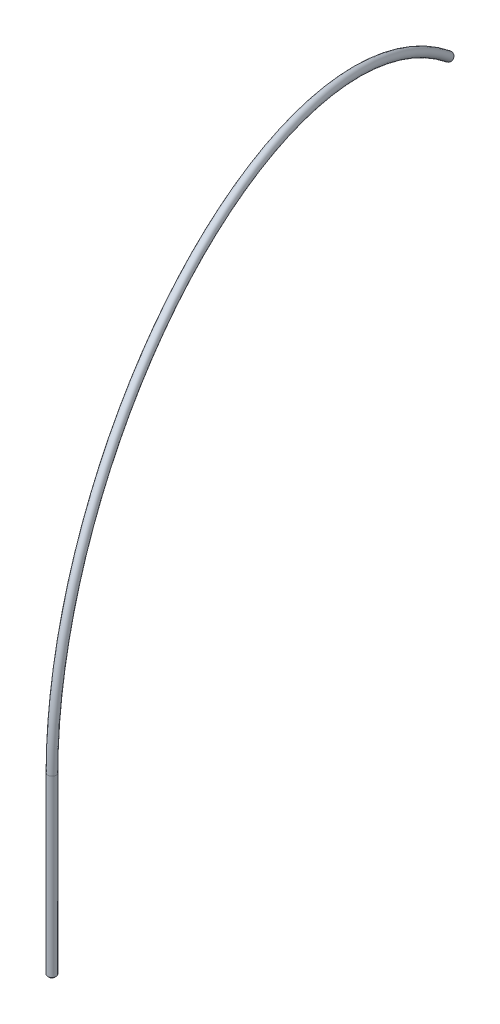
ISO-10303-21;
HEADER;
FILE_DESCRIPTION(('STEP AP214'),'2;1');
FILE_NAME('part.step','',(''),(''),'','','');
FILE_SCHEMA(('AUTOMOTIVE_DESIGN { 1 0 10303 214 1 1 1 1 }'));
ENDSEC;
DATA;
#1=APPLICATION_CONTEXT('core data for automotive mechanical design processes');
#2=APPLICATION_PROTOCOL_DEFINITION('international standard','automotive_design',2000,#1);
#3=PRODUCT_CONTEXT('',#1,'mechanical');
#4=PRODUCT('Part','Part','',(#3));
#5=PRODUCT_RELATED_PRODUCT_CATEGORY('part','',(#4));
#6=PRODUCT_DEFINITION_FORMATION('','',#4);
#7=PRODUCT_DEFINITION_CONTEXT('part definition',#1,'design');
#8=PRODUCT_DEFINITION('design','',#6,#7);
#9=PRODUCT_DEFINITION_SHAPE('','',#8);
#10=(LENGTH_UNIT() NAMED_UNIT(*) SI_UNIT(.MILLI.,.METRE.));
#11=(NAMED_UNIT(*) PLANE_ANGLE_UNIT() SI_UNIT($,.RADIAN.));
#12=(NAMED_UNIT(*) SI_UNIT($,.STERADIAN.) SOLID_ANGLE_UNIT());
#13=UNCERTAINTY_MEASURE_WITH_UNIT(LENGTH_MEASURE(1.E-05),#10,'distance_accuracy_value','');
#14=(GEOMETRIC_REPRESENTATION_CONTEXT(3) GLOBAL_UNCERTAINTY_ASSIGNED_CONTEXT((#13)) GLOBAL_UNIT_ASSIGNED_CONTEXT((#10,
#11,#12)) REPRESENTATION_CONTEXT('',''));
#15=CARTESIAN_POINT('',(0.,0.,0.));
#16=DIRECTION('',(0.,0.,1.));
#17=DIRECTION('',(1.,0.,0.));
#18=AXIS2_PLACEMENT_3D('',#15,#16,#17);
#19=CARTESIAN_POINT('',(0.,0.,0.));
#20=DIRECTION('',(0.,-1.,0.));
#21=DIRECTION('',(0.,0.,-1.));
#22=AXIS2_PLACEMENT_3D('',#19,#20,#21);
#23=CYLINDRICAL_SURFACE('',#22,1.5875);
#24=CARTESIAN_POINT('',(0.,0.,0.));
#25=DIRECTION('',(0.,-1.,0.));
#26=DIRECTION('',(0.,0.,-1.));
#27=AXIS2_PLACEMENT_3D('',#24,#25,#26);
#28=CIRCLE('',#27,1.58750000000001);
#29=CARTESIAN_POINT('',(0.,0.,-1.58750000000001));
#30=VERTEX_POINT('',#29);
#31=EDGE_CURVE('E10',#30,#30,#28,.T.);
#32=ORIENTED_EDGE('',*,*,#31,.T.);
#33=EDGE_LOOP('',(#32));
#34=FACE_BOUND('',#33,.T.);
#35=CARTESIAN_POINT('',(0.,100.79375,0.));
#36=DIRECTION('',(0.,-1.,0.));
#37=DIRECTION('',(0.,0.,-1.));
#38=AXIS2_PLACEMENT_3D('',#35,#36,#37);
#39=CIRCLE('',#38,1.58749999999999);
#40=CARTESIAN_POINT('',(0.427311452455385,100.79375,1.52890849059073));
#41=VERTEX_POINT('',#40);
#42=EDGE_CURVE('E32',#41,#41,#39,.T.);
#43=ORIENTED_EDGE('',*,*,#42,.F.);
#44=EDGE_LOOP('',(#43));
#45=FACE_BOUND('',#44,.T.);
#46=ADVANCED_FACE('F29',(#34,#45),#23,.F.);
#47=CARTESIAN_POINT('',(0.,0.,0.));
#48=DIRECTION('',(0.,1.,0.));
#49=DIRECTION('',(0.,0.,1.));
#50=AXIS2_PLACEMENT_3D('',#47,#48,#49);
#51=CONICAL_SURFACE('',#50,1.58750000000001,0.78539816339745);
#52=CARTESIAN_POINT('',(0.,0.793749999999998,0.));
#53=DIRECTION('',(0.,-1.,0.));
#54=DIRECTION('',(0.,0.,-1.));
#55=AXIS2_PLACEMENT_3D('',#52,#53,#54);
#56=CIRCLE('',#55,2.38125000000001);
#57=CARTESIAN_POINT('',(0.,0.793749999999998,-2.38125000000001));
#58=VERTEX_POINT('',#57);
#59=EDGE_CURVE('E36',#58,#58,#56,.T.);
#60=ORIENTED_EDGE('',*,*,#59,.T.);
#61=EDGE_LOOP('',(#60));
#62=FACE_BOUND('',#61,.T.);
#63=ORIENTED_EDGE('',*,*,#31,.F.);
#64=EDGE_LOOP('',(#63));
#65=FACE_BOUND('',#64,.T.);
#66=ADVANCED_FACE('F74',(#62,#65),#51,.T.);
#67=CARTESIAN_POINT('',(0.,0.,0.));
#68=DIRECTION('',(0.,-1.,0.));
#69=DIRECTION('',(0.,0.,-1.));
#70=AXIS2_PLACEMENT_3D('',#67,#68,#69);
#71=CYLINDRICAL_SURFACE('',#70,2.38125);
#72=CARTESIAN_POINT('',(0.,100.79375,0.));
#73=DIRECTION('',(0.,-1.,0.));
#74=DIRECTION('',(0.,0.,-1.));
#75=AXIS2_PLACEMENT_3D('',#72,#73,#74);
#76=CIRCLE('',#75,2.38124999999999);
#77=CARTESIAN_POINT('',(0.640967178683082,100.79375,2.29336273588612));
#78=VERTEX_POINT('',#77);
#79=EDGE_CURVE('E41',#78,#78,#76,.T.);
#80=ORIENTED_EDGE('',*,*,#79,.T.);
#81=EDGE_LOOP('',(#80));
#82=FACE_BOUND('',#81,.T.);
#83=ORIENTED_EDGE('',*,*,#59,.F.);
#84=EDGE_LOOP('',(#83));
#85=FACE_BOUND('',#84,.T.);
#86=ADVANCED_FACE('F72',(#82,#85),#71,.T.);
#87=CARTESIAN_POINT('',(-53.8345136951666,100.79375,-192.618392515369));
#88=DIRECTION('',(0.963091962576847,0.,-0.269172568475833));
#89=DIRECTION('',(-0.269172568475833,0.,-0.963091962576847));
#90=AXIS2_PLACEMENT_3D('',#87,#88,#89);
#91=TOROIDAL_SURFACE('',#90,200.,1.58749999999999);
#92=CARTESIAN_POINT('',(-88.2162172536232,254.692322300197,-315.635171470028));
#93=DIRECTION('',(-0.207126369954039,-0.638655412643645,-0.741092390171858));
#94=DIRECTION('',(-0.424801649029487,0.741092390171858,-0.519928483746746));
#95=AXIS2_PLACEMENT_3D('',#92,#93,#94);
#96=CIRCLE('',#95,1.58749999999999);
#97=CARTESIAN_POINT('',(-88.4891220256184,255.91389221783,-316.611617152981));
#98=VERTEX_POINT('',#97);
#99=EDGE_CURVE('E52',#98,#98,#96,.T.);
#100=CARTESIAN_POINT('',(-53.8345136951666,100.79375,-192.618392515369));
#101=DIRECTION('',(0.963091962576847,0.,-0.269172568475833));
#102=DIRECTION('',(-0.269172568475833,0.,-0.963091962576847));
#103=AXIS2_PLACEMENT_3D('',#100,#101,#102);
#104=CIRCLE('',#103,201.5875);
#105=EDGE_CURVE('',#98,#41,#104,.T.);
#106=ORIENTED_EDGE('',*,*,#99,.T.);
#107=ORIENTED_EDGE('',*,*,#42,.T.);
#108=ORIENTED_EDGE('',*,*,#105,.T.);
#109=ORIENTED_EDGE('',*,*,#105,.F.);
#110=EDGE_LOOP('',(#106,#108,#107,#109));
#111=FACE_BOUND('',#110,.T.);
#112=ADVANCED_FACE('F59',(#111),#91,.F.);
#113=CARTESIAN_POINT('',(-53.8345136951666,100.79375,-192.618392515369));
#114=DIRECTION('',(0.963091962576847,0.,-0.269172568475833));
#115=DIRECTION('',(-0.269172568475833,0.,-0.963091962576847));
#116=AXIS2_PLACEMENT_3D('',#113,#114,#115);
#117=TOROIDAL_SURFACE('',#116,200.,2.38124999999999);
#118=CARTESIAN_POINT('',(-88.2162172536232,254.692322300197,-315.635171470028));
#119=DIRECTION('',(-0.207126369954039,-0.638655412643645,-0.741092390171858));
#120=DIRECTION('',(-0.424801649029487,0.741092390171858,-0.519928483746746));
#121=AXIS2_PLACEMENT_3D('',#118,#119,#120);
#122=CIRCLE('',#121,2.38124999999999);
#123=CARTESIAN_POINT('',(-88.6255744116161,256.524677176646,-317.099839994457));
#124=VERTEX_POINT('',#123);
#125=EDGE_CURVE('E48',#124,#124,#122,.T.);
#126=CARTESIAN_POINT('',(-53.8345136951666,100.79375,-192.618392515369));
#127=DIRECTION('',(0.963091962576847,0.,-0.269172568475833));
#128=DIRECTION('',(-0.269172568475833,0.,-0.963091962576847));
#129=AXIS2_PLACEMENT_3D('',#126,#127,#128);
#130=CIRCLE('',#129,202.38125);
#131=EDGE_CURVE('',#124,#78,#130,.T.);
#132=ORIENTED_EDGE('',*,*,#125,.F.);
#133=ORIENTED_EDGE('',*,*,#79,.F.);
#134=ORIENTED_EDGE('',*,*,#131,.T.);
#135=ORIENTED_EDGE('',*,*,#131,.F.);
#136=EDGE_LOOP('',(#132,#134,#133,#135));
#137=FACE_BOUND('',#136,.T.);
#138=ADVANCED_FACE('F63',(#137),#117,.T.);
#139=CARTESIAN_POINT('',(-88.2162172536232,254.692322300197,-315.635171470028));
#140=DIRECTION('',(-0.207126369954039,-0.638655412643645,-0.741092390171858));
#141=DIRECTION('',(-0.424801649029487,0.741092390171858,-0.519928483746746));
#142=AXIS2_PLACEMENT_3D('',#139,#140,#141);
#143=PLANE('',#142);
#144=ORIENTED_EDGE('',*,*,#99,.F.);
#145=EDGE_LOOP('',(#144));
#146=FACE_BOUND('',#145,.T.);
#147=ORIENTED_EDGE('',*,*,#125,.T.);
#148=EDGE_LOOP('',(#147));
#149=FACE_BOUND('',#148,.T.);
#150=ADVANCED_FACE('F61',(#146,#149),#143,.T.);
#151=CLOSED_SHELL('',(#46,#66,#86,#112,#138,#150));
#152=MANIFOLD_SOLID_BREP('B2',#151);
#153=ADVANCED_BREP_SHAPE_REPRESENTATION('',(#18,#152),#14);
#154=SHAPE_DEFINITION_REPRESENTATION(#9,#153);
ENDSEC;
END-ISO-10303-21;
